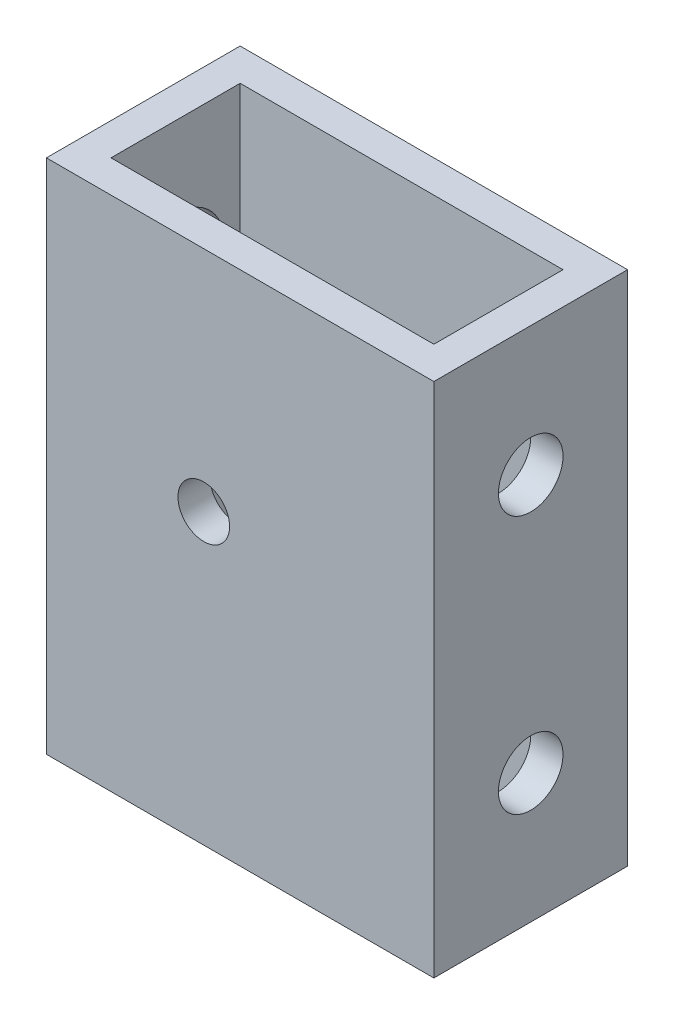
ISO-10303-21;
HEADER;
FILE_DESCRIPTION(('STEP AP214'),'2;1');
FILE_NAME('part.step','',(''),(''),'','','');
FILE_SCHEMA(('AUTOMOTIVE_DESIGN { 1 0 10303 214 1 1 1 1 }'));
ENDSEC;
DATA;
#1=APPLICATION_CONTEXT('core data for automotive mechanical design processes');
#2=APPLICATION_PROTOCOL_DEFINITION('international standard','automotive_design',2000,#1);
#3=PRODUCT_CONTEXT('',#1,'mechanical');
#4=PRODUCT('Part','Part','',(#3));
#5=PRODUCT_RELATED_PRODUCT_CATEGORY('part','',(#4));
#6=PRODUCT_DEFINITION_FORMATION('','',#4);
#7=PRODUCT_DEFINITION_CONTEXT('part definition',#1,'design');
#8=PRODUCT_DEFINITION('design','',#6,#7);
#9=PRODUCT_DEFINITION_SHAPE('','',#8);
#10=(LENGTH_UNIT() NAMED_UNIT(*) SI_UNIT(.MILLI.,.METRE.));
#11=(NAMED_UNIT(*) PLANE_ANGLE_UNIT() SI_UNIT($,.RADIAN.));
#12=(NAMED_UNIT(*) SI_UNIT($,.STERADIAN.) SOLID_ANGLE_UNIT());
#13=UNCERTAINTY_MEASURE_WITH_UNIT(LENGTH_MEASURE(1.E-05),#10,'distance_accuracy_value','');
#14=(GEOMETRIC_REPRESENTATION_CONTEXT(3) GLOBAL_UNCERTAINTY_ASSIGNED_CONTEXT((#13)) GLOBAL_UNIT_ASSIGNED_CONTEXT((#10,
#11,#12)) REPRESENTATION_CONTEXT('',''));
#15=CARTESIAN_POINT('',(0.,0.,0.));
#16=DIRECTION('',(0.,0.,1.));
#17=DIRECTION('',(1.,0.,0.));
#18=AXIS2_PLACEMENT_3D('',#15,#16,#17);
#19=CARTESIAN_POINT('',(0.,50.8,0.));
#20=DIRECTION('',(0.,-1.,0.));
#21=DIRECTION('',(0.,0.,-1.));
#22=AXIS2_PLACEMENT_3D('',#19,#20,#21);
#23=PLANE('',#22);
#24=DIRECTION('',(0.,0.,1.));
#25=VECTOR('',#24,1.);
#26=CARTESIAN_POINT('',(0.,50.8,0.));
#27=LINE('',#26,#25);
#28=CARTESIAN_POINT('',(0.,50.8,-19.05));
#29=VERTEX_POINT('',#28);
#30=CARTESIAN_POINT('',(0.,50.8,0.));
#31=VERTEX_POINT('',#30);
#32=EDGE_CURVE('E153',#29,#31,#27,.T.);
#33=ORIENTED_EDGE('',*,*,#32,.T.);
#34=DIRECTION('',(1.,0.,0.));
#35=VECTOR('',#34,1.);
#36=CARTESIAN_POINT('',(0.,50.8,0.));
#37=LINE('',#36,#35);
#38=CARTESIAN_POINT('',(38.1,50.8,0.));
#39=VERTEX_POINT('',#38);
#40=EDGE_CURVE('E156',#31,#39,#37,.T.);
#41=ORIENTED_EDGE('',*,*,#40,.T.);
#42=DIRECTION('',(0.,0.,-1.));
#43=VECTOR('',#42,1.);
#44=CARTESIAN_POINT('',(38.1,50.8,0.));
#45=LINE('',#44,#43);
#46=CARTESIAN_POINT('',(38.1,50.8,-19.05));
#47=VERTEX_POINT('',#46);
#48=EDGE_CURVE('E159',#39,#47,#45,.T.);
#49=ORIENTED_EDGE('',*,*,#48,.T.);
#50=DIRECTION('',(-1.,0.,0.));
#51=VECTOR('',#50,1.);
#52=CARTESIAN_POINT('',(0.,50.8,-19.05));
#53=LINE('',#52,#51);
#54=EDGE_CURVE('E161',#47,#29,#53,.T.);
#55=ORIENTED_EDGE('',*,*,#54,.T.);
#56=EDGE_LOOP('',(#33,#41,#49,#55));
#57=FACE_BOUND('',#56,.T.);
#58=DIRECTION('',(0.,0.,1.));
#59=VECTOR('',#58,1.);
#60=CARTESIAN_POINT('',(3.175,50.8,-3.175));
#61=LINE('',#60,#59);
#62=CARTESIAN_POINT('',(3.175,50.8,-15.875));
#63=VERTEX_POINT('',#62);
#64=CARTESIAN_POINT('',(3.175,50.8,-3.175));
#65=VERTEX_POINT('',#64);
#66=EDGE_CURVE('E110',#63,#65,#61,.T.);
#67=ORIENTED_EDGE('',*,*,#66,.F.);
#68=DIRECTION('',(-1.,0.,0.));
#69=VECTOR('',#68,1.);
#70=CARTESIAN_POINT('',(3.175,50.8,-15.875));
#71=LINE('',#70,#69);
#72=CARTESIAN_POINT('',(34.925,50.8,-15.875));
#73=VERTEX_POINT('',#72);
#74=EDGE_CURVE('E133',#73,#63,#71,.T.);
#75=ORIENTED_EDGE('',*,*,#74,.F.);
#76=DIRECTION('',(0.,0.,-1.));
#77=VECTOR('',#76,1.);
#78=CARTESIAN_POINT('',(34.925,50.8,-3.175));
#79=LINE('',#78,#77);
#80=CARTESIAN_POINT('',(34.925,50.8,-3.175));
#81=VERTEX_POINT('',#80);
#82=EDGE_CURVE('E131',#81,#73,#79,.T.);
#83=ORIENTED_EDGE('',*,*,#82,.F.);
#84=DIRECTION('',(1.,0.,0.));
#85=VECTOR('',#84,1.);
#86=CARTESIAN_POINT('',(3.175,50.8,-3.175));
#87=LINE('',#86,#85);
#88=EDGE_CURVE('E118',#65,#81,#87,.T.);
#89=ORIENTED_EDGE('',*,*,#88,.F.);
#90=EDGE_LOOP('',(#67,#75,#83,#89));
#91=FACE_BOUND('',#90,.T.);
#92=ADVANCED_FACE('F39',(#57,#91),#23,.F.);
#93=CARTESIAN_POINT('',(0.,0.,0.));
#94=DIRECTION('',(0.,-1.,0.));
#95=DIRECTION('',(0.,0.,-1.));
#96=AXIS2_PLACEMENT_3D('',#93,#94,#95);
#97=PLANE('',#96);
#98=DIRECTION('',(0.,0.,1.));
#99=VECTOR('',#98,1.);
#100=CARTESIAN_POINT('',(0.,0.,0.));
#101=LINE('',#100,#99);
#102=CARTESIAN_POINT('',(0.,0.,-19.05));
#103=VERTEX_POINT('',#102);
#104=CARTESIAN_POINT('',(0.,0.,0.));
#105=VERTEX_POINT('',#104);
#106=EDGE_CURVE('E127',#103,#105,#101,.T.);
#107=ORIENTED_EDGE('',*,*,#106,.F.);
#108=DIRECTION('',(-1.,0.,0.));
#109=VECTOR('',#108,1.);
#110=CARTESIAN_POINT('',(0.,0.,-19.05));
#111=LINE('',#110,#109);
#112=CARTESIAN_POINT('',(38.1,0.,-19.05));
#113=VERTEX_POINT('',#112);
#114=EDGE_CURVE('E157',#113,#103,#111,.T.);
#115=ORIENTED_EDGE('',*,*,#114,.F.);
#116=DIRECTION('',(0.,0.,-1.));
#117=VECTOR('',#116,1.);
#118=CARTESIAN_POINT('',(38.1,0.,0.));
#119=LINE('',#118,#117);
#120=CARTESIAN_POINT('',(38.1,0.,0.));
#121=VERTEX_POINT('',#120);
#122=EDGE_CURVE('E170',#121,#113,#119,.T.);
#123=ORIENTED_EDGE('',*,*,#122,.F.);
#124=DIRECTION('',(1.,0.,0.));
#125=VECTOR('',#124,1.);
#126=CARTESIAN_POINT('',(0.,0.,0.));
#127=LINE('',#126,#125);
#128=EDGE_CURVE('E167',#105,#121,#127,.T.);
#129=ORIENTED_EDGE('',*,*,#128,.F.);
#130=EDGE_LOOP('',(#107,#115,#123,#129));
#131=FACE_BOUND('',#130,.T.);
#132=DIRECTION('',(-1.,0.,0.));
#133=VECTOR('',#132,1.);
#134=CARTESIAN_POINT('',(3.175,0.,-15.875));
#135=LINE('',#134,#133);
#136=CARTESIAN_POINT('',(34.925,0.,-15.875));
#137=VERTEX_POINT('',#136);
#138=CARTESIAN_POINT('',(3.175,0.,-15.875));
#139=VERTEX_POINT('',#138);
#140=EDGE_CURVE('E119',#137,#139,#135,.T.);
#141=ORIENTED_EDGE('',*,*,#140,.T.);
#142=DIRECTION('',(0.,0.,1.));
#143=VECTOR('',#142,1.);
#144=CARTESIAN_POINT('',(3.175,0.,-3.175));
#145=LINE('',#144,#143);
#146=CARTESIAN_POINT('',(3.175,0.,-3.175));
#147=VERTEX_POINT('',#146);
#148=EDGE_CURVE('E67',#139,#147,#145,.T.);
#149=ORIENTED_EDGE('',*,*,#148,.T.);
#150=DIRECTION('',(1.,0.,0.));
#151=VECTOR('',#150,1.);
#152=CARTESIAN_POINT('',(3.175,0.,-3.175));
#153=LINE('',#152,#151);
#154=CARTESIAN_POINT('',(34.925,0.,-3.175));
#155=VERTEX_POINT('',#154);
#156=EDGE_CURVE('E125',#147,#155,#153,.T.);
#157=ORIENTED_EDGE('',*,*,#156,.T.);
#158=DIRECTION('',(0.,0.,-1.));
#159=VECTOR('',#158,1.);
#160=CARTESIAN_POINT('',(34.925,0.,-3.175));
#161=LINE('',#160,#159);
#162=EDGE_CURVE('E143',#155,#137,#161,.T.);
#163=ORIENTED_EDGE('',*,*,#162,.T.);
#164=EDGE_LOOP('',(#141,#149,#157,#163));
#165=FACE_BOUND('',#164,.T.);
#166=ADVANCED_FACE('F224',(#131,#165),#97,.T.);
#167=CARTESIAN_POINT('',(0.,50.8,0.));
#168=DIRECTION('',(1.,0.,0.));
#169=DIRECTION('',(0.,0.,-1.));
#170=AXIS2_PLACEMENT_3D('',#167,#168,#169);
#171=PLANE('',#170);
#172=CARTESIAN_POINT('',(0.,38.1,-9.525));
#173=DIRECTION('',(-1.,0.,0.));
#174=DIRECTION('',(0.,0.,1.));
#175=AXIS2_PLACEMENT_3D('',#172,#173,#174);
#176=CIRCLE('',#175,4.7625);
#177=CARTESIAN_POINT('',(0.,38.1,-4.7625));
#178=VERTEX_POINT('',#177);
#179=EDGE_CURVE('E209',#178,#178,#176,.T.);
#180=ORIENTED_EDGE('',*,*,#179,.F.);
#181=EDGE_LOOP('',(#180));
#182=FACE_BOUND('',#181,.T.);
#183=CARTESIAN_POINT('',(0.,12.7,-9.52500000000001));
#184=DIRECTION('',(-1.,0.,0.));
#185=DIRECTION('',(0.,0.,1.));
#186=AXIS2_PLACEMENT_3D('',#183,#184,#185);
#187=CIRCLE('',#186,4.7625);
#188=CARTESIAN_POINT('',(0.,12.7,-4.76250000000001));
#189=VERTEX_POINT('',#188);
#190=EDGE_CURVE('E202',#189,#189,#187,.T.);
#191=ORIENTED_EDGE('',*,*,#190,.F.);
#192=EDGE_LOOP('',(#191));
#193=FACE_BOUND('',#192,.T.);
#194=ORIENTED_EDGE('',*,*,#106,.T.);
#195=DIRECTION('',(0.,-1.,0.));
#196=VECTOR('',#195,1.);
#197=CARTESIAN_POINT('',(0.,50.8,0.));
#198=LINE('',#197,#196);
#199=EDGE_CURVE('E11',#31,#105,#198,.T.);
#200=ORIENTED_EDGE('',*,*,#199,.F.);
#201=ORIENTED_EDGE('',*,*,#32,.F.);
#202=DIRECTION('',(0.,-1.,0.));
#203=VECTOR('',#202,1.);
#204=CARTESIAN_POINT('',(0.,50.8,-19.05));
#205=LINE('',#204,#203);
#206=EDGE_CURVE('E163',#29,#103,#205,.T.);
#207=ORIENTED_EDGE('',*,*,#206,.T.);
#208=EDGE_LOOP('',(#194,#200,#201,#207));
#209=FACE_BOUND('',#208,.T.);
#210=ADVANCED_FACE('F41',(#182,#193,#209),#171,.F.);
#211=CARTESIAN_POINT('',(0.,50.8,0.));
#212=DIRECTION('',(0.,0.,-1.));
#213=DIRECTION('',(-1.,0.,0.));
#214=AXIS2_PLACEMENT_3D('',#211,#212,#213);
#215=PLANE('',#214);
#216=CARTESIAN_POINT('',(15.4733780782981,28.3956136069789,0.));
#217=DIRECTION('',(0.,0.,1.));
#218=DIRECTION('',(1.,0.,0.));
#219=AXIS2_PLACEMENT_3D('',#216,#217,#218);
#220=CIRCLE('',#219,2.54);
#221=CARTESIAN_POINT('',(18.0133780782982,28.3956136069789,0.));
#222=VERTEX_POINT('',#221);
#223=EDGE_CURVE('E198',#222,#222,#220,.T.);
#224=ORIENTED_EDGE('',*,*,#223,.F.);
#225=EDGE_LOOP('',(#224));
#226=FACE_BOUND('',#225,.T.);
#227=ORIENTED_EDGE('',*,*,#128,.T.);
#228=DIRECTION('',(0.,-1.,0.));
#229=VECTOR('',#228,1.);
#230=CARTESIAN_POINT('',(38.1,50.8,0.));
#231=LINE('',#230,#229);
#232=EDGE_CURVE('E49',#39,#121,#231,.T.);
#233=ORIENTED_EDGE('',*,*,#232,.F.);
#234=ORIENTED_EDGE('',*,*,#40,.F.);
#235=ORIENTED_EDGE('',*,*,#199,.T.);
#236=EDGE_LOOP('',(#227,#233,#234,#235));
#237=FACE_BOUND('',#236,.T.);
#238=ADVANCED_FACE('F223',(#226,#237),#215,.F.);
#239=CARTESIAN_POINT('',(38.1,50.8,0.));
#240=DIRECTION('',(-1.,0.,0.));
#241=DIRECTION('',(0.,0.,1.));
#242=AXIS2_PLACEMENT_3D('',#239,#240,#241);
#243=PLANE('',#242);
#244=CARTESIAN_POINT('',(38.1,12.7,-9.52500000000001));
#245=DIRECTION('',(1.,0.,0.));
#246=DIRECTION('',(0.,0.,1.));
#247=AXIS2_PLACEMENT_3D('',#244,#245,#246);
#248=CIRCLE('',#247,3.175);
#249=CARTESIAN_POINT('',(38.1,12.7,-6.35000000000001));
#250=VERTEX_POINT('',#249);
#251=EDGE_CURVE('E186',#250,#250,#248,.T.);
#252=ORIENTED_EDGE('',*,*,#251,.F.);
#253=EDGE_LOOP('',(#252));
#254=FACE_BOUND('',#253,.T.);
#255=CARTESIAN_POINT('',(38.1,38.1,-9.525));
#256=DIRECTION('',(1.,0.,0.));
#257=DIRECTION('',(0.,0.,-1.));
#258=AXIS2_PLACEMENT_3D('',#255,#256,#257);
#259=CIRCLE('',#258,3.175);
#260=CARTESIAN_POINT('',(38.1,38.1,-12.7));
#261=VERTEX_POINT('',#260);
#262=EDGE_CURVE('E183',#261,#261,#259,.T.);
#263=ORIENTED_EDGE('',*,*,#262,.F.);
#264=EDGE_LOOP('',(#263));
#265=FACE_BOUND('',#264,.T.);
#266=ORIENTED_EDGE('',*,*,#122,.T.);
#267=DIRECTION('',(0.,-1.,0.));
#268=VECTOR('',#267,1.);
#269=CARTESIAN_POINT('',(38.1,50.8,-19.05));
#270=LINE('',#269,#268);
#271=EDGE_CURVE('E177',#47,#113,#270,.T.);
#272=ORIENTED_EDGE('',*,*,#271,.F.);
#273=ORIENTED_EDGE('',*,*,#48,.F.);
#274=ORIENTED_EDGE('',*,*,#232,.T.);
#275=EDGE_LOOP('',(#266,#272,#273,#274));
#276=FACE_BOUND('',#275,.T.);
#277=ADVANCED_FACE('F244',(#254,#265,#276),#243,.F.);
#278=CARTESIAN_POINT('',(0.,50.8,-19.05));
#279=DIRECTION('',(0.,0.,1.));
#280=DIRECTION('',(1.,0.,0.));
#281=AXIS2_PLACEMENT_3D('',#278,#279,#280);
#282=PLANE('',#281);
#283=CARTESIAN_POINT('',(15.4733780782981,28.3956136069789,-19.05));
#284=DIRECTION('',(0.,0.,1.));
#285=DIRECTION('',(1.,0.,0.));
#286=AXIS2_PLACEMENT_3D('',#283,#284,#285);
#287=CIRCLE('',#286,2.54);
#288=CARTESIAN_POINT('',(18.0133780782982,28.3956136069789,-19.05));
#289=VERTEX_POINT('',#288);
#290=EDGE_CURVE('E201',#289,#289,#287,.T.);
#291=ORIENTED_EDGE('',*,*,#290,.T.);
#292=EDGE_LOOP('',(#291));
#293=FACE_BOUND('',#292,.T.);
#294=ORIENTED_EDGE('',*,*,#114,.T.);
#295=ORIENTED_EDGE('',*,*,#206,.F.);
#296=ORIENTED_EDGE('',*,*,#54,.F.);
#297=ORIENTED_EDGE('',*,*,#271,.T.);
#298=EDGE_LOOP('',(#294,#295,#296,#297));
#299=FACE_BOUND('',#298,.T.);
#300=ADVANCED_FACE('F242',(#293,#299),#282,.F.);
#301=CARTESIAN_POINT('',(3.175,50.8,-3.175));
#302=DIRECTION('',(1.,0.,0.));
#303=DIRECTION('',(0.,0.,-1.));
#304=AXIS2_PLACEMENT_3D('',#301,#302,#303);
#305=PLANE('',#304);
#306=CARTESIAN_POINT('',(3.175,38.1,-9.525));
#307=DIRECTION('',(1.,0.,0.));
#308=DIRECTION('',(0.,0.,-1.));
#309=AXIS2_PLACEMENT_3D('',#306,#307,#308);
#310=CIRCLE('',#309,4.7625);
#311=CARTESIAN_POINT('',(3.175,38.1,-14.2875));
#312=VERTEX_POINT('',#311);
#313=EDGE_CURVE('E213',#312,#312,#310,.F.);
#314=ORIENTED_EDGE('',*,*,#313,.T.);
#315=EDGE_LOOP('',(#314));
#316=FACE_BOUND('',#315,.T.);
#317=CARTESIAN_POINT('',(3.175,12.7,-9.52500000000001));
#318=DIRECTION('',(1.,0.,0.));
#319=DIRECTION('',(0.,0.,-1.));
#320=AXIS2_PLACEMENT_3D('',#317,#318,#319);
#321=CIRCLE('',#320,4.7625);
#322=CARTESIAN_POINT('',(3.175,12.7,-14.2875));
#323=VERTEX_POINT('',#322);
#324=EDGE_CURVE('E205',#323,#323,#321,.F.);
#325=ORIENTED_EDGE('',*,*,#324,.T.);
#326=EDGE_LOOP('',(#325));
#327=FACE_BOUND('',#326,.T.);
#328=ORIENTED_EDGE('',*,*,#148,.F.);
#329=DIRECTION('',(0.,-1.,0.));
#330=VECTOR('',#329,1.);
#331=CARTESIAN_POINT('',(3.175,50.8,-15.875));
#332=LINE('',#331,#330);
#333=EDGE_CURVE('E114',#63,#139,#332,.T.);
#334=ORIENTED_EDGE('',*,*,#333,.F.);
#335=ORIENTED_EDGE('',*,*,#66,.T.);
#336=DIRECTION('',(0.,-1.,0.));
#337=VECTOR('',#336,1.);
#338=CARTESIAN_POINT('',(3.175,50.8,-3.175));
#339=LINE('',#338,#337);
#340=EDGE_CURVE('E113',#65,#147,#339,.T.);
#341=ORIENTED_EDGE('',*,*,#340,.T.);
#342=EDGE_LOOP('',(#328,#334,#335,#341));
#343=FACE_BOUND('',#342,.T.);
#344=ADVANCED_FACE('F112',(#316,#327,#343),#305,.T.);
#345=CARTESIAN_POINT('',(3.175,50.8,-3.175));
#346=DIRECTION('',(0.,0.,-1.));
#347=DIRECTION('',(-1.,0.,0.));
#348=AXIS2_PLACEMENT_3D('',#345,#346,#347);
#349=PLANE('',#348);
#350=CARTESIAN_POINT('',(15.4733780782981,28.3956136069789,-3.175));
#351=DIRECTION('',(0.,0.,-1.));
#352=DIRECTION('',(-1.,0.,0.));
#353=AXIS2_PLACEMENT_3D('',#350,#351,#352);
#354=CIRCLE('',#353,2.54);
#355=CARTESIAN_POINT('',(12.9333780782981,28.3956136069789,-3.175));
#356=VERTEX_POINT('',#355);
#357=EDGE_CURVE('E191',#356,#356,#354,.T.);
#358=ORIENTED_EDGE('',*,*,#357,.F.);
#359=EDGE_LOOP('',(#358));
#360=FACE_BOUND('',#359,.T.);
#361=ORIENTED_EDGE('',*,*,#156,.F.);
#362=ORIENTED_EDGE('',*,*,#340,.F.);
#363=ORIENTED_EDGE('',*,*,#88,.T.);
#364=DIRECTION('',(0.,-1.,0.));
#365=VECTOR('',#364,1.);
#366=CARTESIAN_POINT('',(34.925,50.8,-3.175));
#367=LINE('',#366,#365);
#368=EDGE_CURVE('E128',#81,#155,#367,.T.);
#369=ORIENTED_EDGE('',*,*,#368,.T.);
#370=EDGE_LOOP('',(#361,#362,#363,#369));
#371=FACE_BOUND('',#370,.T.);
#372=ADVANCED_FACE('F122',(#360,#371),#349,.T.);
#373=CARTESIAN_POINT('',(34.925,50.8,-3.175));
#374=DIRECTION('',(-1.,0.,0.));
#375=DIRECTION('',(0.,0.,1.));
#376=AXIS2_PLACEMENT_3D('',#373,#374,#375);
#377=PLANE('',#376);
#378=CARTESIAN_POINT('',(34.925,12.7,-9.52500000000001));
#379=DIRECTION('',(-1.,0.,0.));
#380=DIRECTION('',(0.,0.,1.));
#381=AXIS2_PLACEMENT_3D('',#378,#379,#380);
#382=CIRCLE('',#381,3.175);
#383=CARTESIAN_POINT('',(34.925,12.7,-6.35000000000001));
#384=VERTEX_POINT('',#383);
#385=EDGE_CURVE('E184',#384,#384,#382,.T.);
#386=ORIENTED_EDGE('',*,*,#385,.F.);
#387=EDGE_LOOP('',(#386));
#388=FACE_BOUND('',#387,.T.);
#389=CARTESIAN_POINT('',(34.925,38.1,-9.525));
#390=DIRECTION('',(-1.,0.,0.));
#391=DIRECTION('',(0.,0.,1.));
#392=AXIS2_PLACEMENT_3D('',#389,#390,#391);
#393=CIRCLE('',#392,3.175);
#394=CARTESIAN_POINT('',(34.925,38.1,-6.35));
#395=VERTEX_POINT('',#394);
#396=EDGE_CURVE('E140',#395,#395,#393,.T.);
#397=ORIENTED_EDGE('',*,*,#396,.F.);
#398=EDGE_LOOP('',(#397));
#399=FACE_BOUND('',#398,.T.);
#400=ORIENTED_EDGE('',*,*,#162,.F.);
#401=ORIENTED_EDGE('',*,*,#368,.F.);
#402=ORIENTED_EDGE('',*,*,#82,.T.);
#403=DIRECTION('',(0.,-1.,0.));
#404=VECTOR('',#403,1.);
#405=CARTESIAN_POINT('',(34.925,50.8,-15.875));
#406=LINE('',#405,#404);
#407=EDGE_CURVE('E57',#73,#137,#406,.T.);
#408=ORIENTED_EDGE('',*,*,#407,.T.);
#409=EDGE_LOOP('',(#400,#401,#402,#408));
#410=FACE_BOUND('',#409,.T.);
#411=ADVANCED_FACE('F268',(#388,#399,#410),#377,.T.);
#412=CARTESIAN_POINT('',(3.175,50.8,-15.875));
#413=DIRECTION('',(0.,0.,1.));
#414=DIRECTION('',(1.,0.,0.));
#415=AXIS2_PLACEMENT_3D('',#412,#413,#414);
#416=PLANE('',#415);
#417=CARTESIAN_POINT('',(15.4733780782981,28.3956136069789,-15.875));
#418=DIRECTION('',(0.,0.,1.));
#419=DIRECTION('',(1.,0.,0.));
#420=AXIS2_PLACEMENT_3D('',#417,#418,#419);
#421=CIRCLE('',#420,2.54);
#422=CARTESIAN_POINT('',(18.0133780782982,28.3956136069789,-15.875));
#423=VERTEX_POINT('',#422);
#424=EDGE_CURVE('E43',#423,#423,#421,.T.);
#425=ORIENTED_EDGE('',*,*,#424,.F.);
#426=EDGE_LOOP('',(#425));
#427=FACE_BOUND('',#426,.T.);
#428=ORIENTED_EDGE('',*,*,#140,.F.);
#429=ORIENTED_EDGE('',*,*,#407,.F.);
#430=ORIENTED_EDGE('',*,*,#74,.T.);
#431=ORIENTED_EDGE('',*,*,#333,.T.);
#432=EDGE_LOOP('',(#428,#429,#430,#431));
#433=FACE_BOUND('',#432,.T.);
#434=ADVANCED_FACE('F272',(#427,#433),#416,.T.);
#435=CARTESIAN_POINT('',(0.,38.1,-9.525));
#436=DIRECTION('',(1.,0.,0.));
#437=DIRECTION('',(0.,0.,-1.));
#438=AXIS2_PLACEMENT_3D('',#435,#436,#437);
#439=CYLINDRICAL_SURFACE('',#438,3.175);
#440=ORIENTED_EDGE('',*,*,#396,.T.);
#441=EDGE_LOOP('',(#440));
#442=FACE_BOUND('',#441,.T.);
#443=ORIENTED_EDGE('',*,*,#262,.T.);
#444=EDGE_LOOP('',(#443));
#445=FACE_BOUND('',#444,.T.);
#446=ADVANCED_FACE('F276',(#442,#445),#439,.F.);
#447=CARTESIAN_POINT('',(0.,12.7,-9.52500000000001));
#448=DIRECTION('',(1.,0.,0.));
#449=DIRECTION('',(0.,0.,-1.));
#450=AXIS2_PLACEMENT_3D('',#447,#448,#449);
#451=CYLINDRICAL_SURFACE('',#450,3.175);
#452=ORIENTED_EDGE('',*,*,#385,.T.);
#453=EDGE_LOOP('',(#452));
#454=FACE_BOUND('',#453,.T.);
#455=ORIENTED_EDGE('',*,*,#251,.T.);
#456=EDGE_LOOP('',(#455));
#457=FACE_BOUND('',#456,.T.);
#458=ADVANCED_FACE('F280',(#454,#457),#451,.F.);
#459=CARTESIAN_POINT('',(15.4733780782981,28.3956136069789,-19.05));
#460=DIRECTION('',(0.,0.,1.));
#461=DIRECTION('',(1.,0.,0.));
#462=AXIS2_PLACEMENT_3D('',#459,#460,#461);
#463=CYLINDRICAL_SURFACE('',#462,2.54);
#464=ORIENTED_EDGE('',*,*,#424,.T.);
#465=EDGE_LOOP('',(#464));
#466=FACE_BOUND('',#465,.T.);
#467=ORIENTED_EDGE('',*,*,#290,.F.);
#468=EDGE_LOOP('',(#467));
#469=FACE_BOUND('',#468,.T.);
#470=ADVANCED_FACE('F284',(#466,#469),#463,.F.);
#471=ORIENTED_EDGE('',*,*,#357,.T.);
#472=EDGE_LOOP('',(#471));
#473=FACE_BOUND('',#472,.T.);
#474=ORIENTED_EDGE('',*,*,#223,.T.);
#475=EDGE_LOOP('',(#474));
#476=FACE_BOUND('',#475,.T.);
#477=ADVANCED_FACE('F287',(#473,#476),#463,.F.);
#478=CARTESIAN_POINT('',(38.101,12.7,-9.52500000000001));
#479=DIRECTION('',(-1.,0.,0.));
#480=DIRECTION('',(0.,0.,1.));
#481=AXIS2_PLACEMENT_3D('',#478,#479,#480);
#482=CYLINDRICAL_SURFACE('',#481,4.7625);
#483=ORIENTED_EDGE('',*,*,#324,.F.);
#484=EDGE_LOOP('',(#483));
#485=FACE_BOUND('',#484,.T.);
#486=ORIENTED_EDGE('',*,*,#190,.T.);
#487=EDGE_LOOP('',(#486));
#488=FACE_BOUND('',#487,.T.);
#489=ADVANCED_FACE('F289',(#485,#488),#482,.F.);
#490=CARTESIAN_POINT('',(38.101,38.1,-9.525));
#491=DIRECTION('',(-1.,0.,0.));
#492=DIRECTION('',(0.,0.,1.));
#493=AXIS2_PLACEMENT_3D('',#490,#491,#492);
#494=CYLINDRICAL_SURFACE('',#493,4.7625);
#495=ORIENTED_EDGE('',*,*,#313,.F.);
#496=EDGE_LOOP('',(#495));
#497=FACE_BOUND('',#496,.T.);
#498=ORIENTED_EDGE('',*,*,#179,.T.);
#499=EDGE_LOOP('',(#498));
#500=FACE_BOUND('',#499,.T.);
#501=ADVANCED_FACE('F219',(#497,#500),#494,.F.);
#502=CLOSED_SHELL('',(#92,#166,#210,#238,#277,#300,#344,#372,#411,#434,#446,#458,#470,#477,#489,#501));
#503=MANIFOLD_SOLID_BREP('B2',#502);
#504=ADVANCED_BREP_SHAPE_REPRESENTATION('',(#18,#503),#14);
#505=SHAPE_DEFINITION_REPRESENTATION(#9,#504);
ENDSEC;
END-ISO-10303-21;
